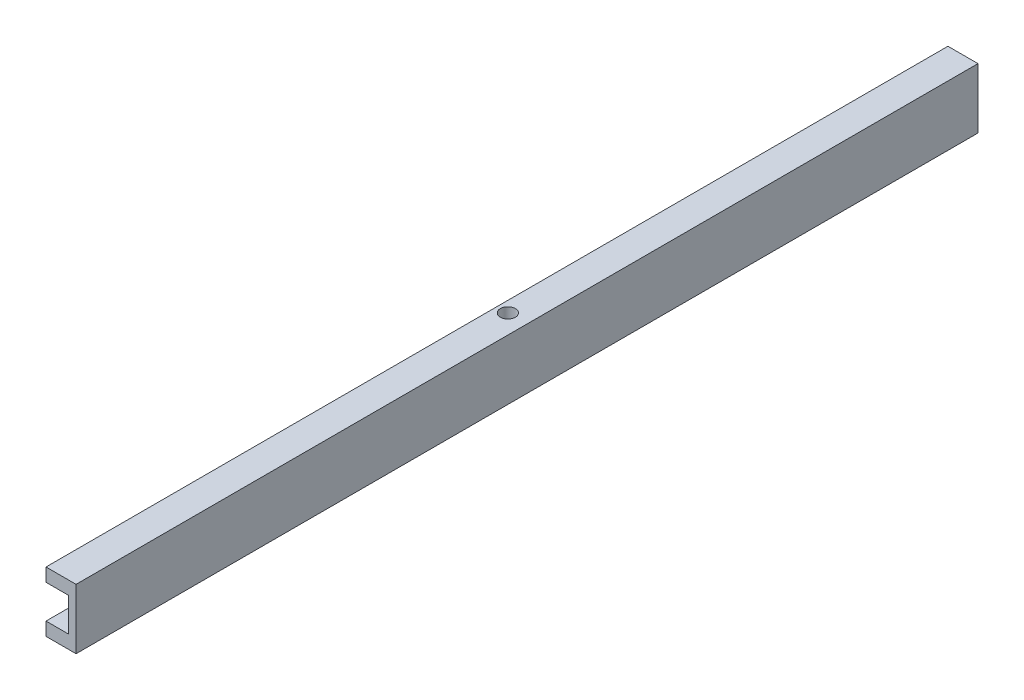
ISO-10303-21;
HEADER;
FILE_DESCRIPTION(('STEP AP214'),'2;1');
FILE_NAME('part.step','',(''),(''),'','','');
FILE_SCHEMA(('AUTOMOTIVE_DESIGN { 1 0 10303 214 1 1 1 1 }'));
ENDSEC;
DATA;
#1=APPLICATION_CONTEXT('core data for automotive mechanical design processes');
#2=APPLICATION_PROTOCOL_DEFINITION('international standard','automotive_design',2000,#1);
#3=PRODUCT_CONTEXT('',#1,'mechanical');
#4=PRODUCT('Part','Part','',(#3));
#5=PRODUCT_RELATED_PRODUCT_CATEGORY('part','',(#4));
#6=PRODUCT_DEFINITION_FORMATION('','',#4);
#7=PRODUCT_DEFINITION_CONTEXT('part definition',#1,'design');
#8=PRODUCT_DEFINITION('design','',#6,#7);
#9=PRODUCT_DEFINITION_SHAPE('','',#8);
#10=(LENGTH_UNIT() NAMED_UNIT(*) SI_UNIT(.MILLI.,.METRE.));
#11=(NAMED_UNIT(*) PLANE_ANGLE_UNIT() SI_UNIT($,.RADIAN.));
#12=(NAMED_UNIT(*) SI_UNIT($,.STERADIAN.) SOLID_ANGLE_UNIT());
#13=UNCERTAINTY_MEASURE_WITH_UNIT(LENGTH_MEASURE(1.E-05),#10,'distance_accuracy_value','');
#14=(GEOMETRIC_REPRESENTATION_CONTEXT(3) GLOBAL_UNCERTAINTY_ASSIGNED_CONTEXT((#13)) GLOBAL_UNIT_ASSIGNED_CONTEXT((#10,
#11,#12)) REPRESENTATION_CONTEXT('',''));
#15=CARTESIAN_POINT('',(0.,0.,0.));
#16=DIRECTION('',(0.,0.,1.));
#17=DIRECTION('',(1.,0.,0.));
#18=AXIS2_PLACEMENT_3D('',#15,#16,#17);
#19=CARTESIAN_POINT('',(9.525,0.,381.));
#20=DIRECTION('',(1.,0.,0.));
#21=DIRECTION('',(0.,1.,0.));
#22=AXIS2_PLACEMENT_3D('',#19,#20,#21);
#23=PLANE('',#22);
#24=DIRECTION('',(0.,-1.,0.));
#25=VECTOR('',#24,1.);
#26=CARTESIAN_POINT('',(9.525,0.,0.));
#27=LINE('',#26,#25);
#28=CARTESIAN_POINT('',(9.525,19.787500049,0.));
#29=VERTEX_POINT('',#28);
#30=CARTESIAN_POINT('',(9.525,5.612499951,0.));
#31=VERTEX_POINT('',#30);
#32=EDGE_CURVE('E157',#29,#31,#27,.T.);
#33=ORIENTED_EDGE('',*,*,#32,.T.);
#34=DIRECTION('',(0.,0.,-1.));
#35=VECTOR('',#34,1.);
#36=CARTESIAN_POINT('',(9.525,5.612499951,381.));
#37=LINE('',#36,#35);
#38=CARTESIAN_POINT('',(9.525,5.612499951,381.));
#39=VERTEX_POINT('',#38);
#40=EDGE_CURVE('E11',#39,#31,#37,.T.);
#41=ORIENTED_EDGE('',*,*,#40,.F.);
#42=DIRECTION('',(0.,-1.,0.));
#43=VECTOR('',#42,1.);
#44=CARTESIAN_POINT('',(9.525,0.,381.));
#45=LINE('',#44,#43);
#46=CARTESIAN_POINT('',(9.525,19.787500049,381.));
#47=VERTEX_POINT('',#46);
#48=EDGE_CURVE('E149',#47,#39,#45,.T.);
#49=ORIENTED_EDGE('',*,*,#48,.F.);
#50=DIRECTION('',(0.,0.,-1.));
#51=VECTOR('',#50,1.);
#52=CARTESIAN_POINT('',(9.525,19.787500049,381.));
#53=LINE('',#52,#51);
#54=EDGE_CURVE('E138',#47,#29,#53,.T.);
#55=ORIENTED_EDGE('',*,*,#54,.T.);
#56=EDGE_LOOP('',(#33,#41,#49,#55));
#57=FACE_BOUND('',#56,.T.);
#58=ADVANCED_FACE('F41',(#57),#23,.F.);
#59=CARTESIAN_POINT('',(0.,5.612499951,381.));
#60=DIRECTION('',(0.,-1.,0.));
#61=DIRECTION('',(1.,0.,0.));
#62=AXIS2_PLACEMENT_3D('',#59,#60,#61);
#63=PLANE('',#62);
#64=CARTESIAN_POINT('',(4.60375,5.61249995099999,190.5));
#65=DIRECTION('',(0.,-1.,0.));
#66=DIRECTION('',(1.,0.,0.));
#67=AXIS2_PLACEMENT_3D('',#64,#65,#66);
#68=CIRCLE('',#67,3.175);
#69=CARTESIAN_POINT('',(7.77875,5.61249995099999,190.5));
#70=VERTEX_POINT('',#69);
#71=EDGE_CURVE('E153',#70,#70,#68,.T.);
#72=ORIENTED_EDGE('',*,*,#71,.T.);
#73=EDGE_LOOP('',(#72));
#74=FACE_BOUND('',#73,.T.);
#75=DIRECTION('',(-1.,0.,0.));
#76=VECTOR('',#75,1.);
#77=CARTESIAN_POINT('',(0.,5.612499951,0.));
#78=LINE('',#77,#76);
#79=CARTESIAN_POINT('',(0.,5.612499951,0.));
#80=VERTEX_POINT('',#79);
#81=EDGE_CURVE('E199',#31,#80,#78,.T.);
#82=ORIENTED_EDGE('',*,*,#81,.T.);
#83=DIRECTION('',(0.,0.,-1.));
#84=VECTOR('',#83,1.);
#85=CARTESIAN_POINT('',(0.,5.612499951,381.));
#86=LINE('',#85,#84);
#87=CARTESIAN_POINT('',(0.,5.612499951,381.));
#88=VERTEX_POINT('',#87);
#89=EDGE_CURVE('E51',#88,#80,#86,.T.);
#90=ORIENTED_EDGE('',*,*,#89,.F.);
#91=DIRECTION('',(-1.,0.,0.));
#92=VECTOR('',#91,1.);
#93=CARTESIAN_POINT('',(0.,5.612499951,381.));
#94=LINE('',#93,#92);
#95=EDGE_CURVE('E98',#39,#88,#94,.T.);
#96=ORIENTED_EDGE('',*,*,#95,.F.);
#97=ORIENTED_EDGE('',*,*,#40,.T.);
#98=EDGE_LOOP('',(#82,#90,#96,#97));
#99=FACE_BOUND('',#98,.T.);
#100=ADVANCED_FACE('F187',(#74,#99),#63,.F.);
#101=CARTESIAN_POINT('',(0.,0.,381.));
#102=DIRECTION('',(-1.,0.,0.));
#103=DIRECTION('',(0.,-1.,0.));
#104=AXIS2_PLACEMENT_3D('',#101,#102,#103);
#105=PLANE('',#104);
#106=DIRECTION('',(0.,1.,0.));
#107=VECTOR('',#106,1.);
#108=CARTESIAN_POINT('',(0.,0.,0.));
#109=LINE('',#108,#107);
#110=CARTESIAN_POINT('',(0.,0.,0.));
#111=VERTEX_POINT('',#110);
#112=EDGE_CURVE('E203',#111,#80,#109,.T.);
#113=ORIENTED_EDGE('',*,*,#112,.F.);
#114=DIRECTION('',(0.,0.,-1.));
#115=VECTOR('',#114,1.);
#116=CARTESIAN_POINT('',(0.,0.,381.));
#117=LINE('',#116,#115);
#118=CARTESIAN_POINT('',(0.,0.,381.));
#119=VERTEX_POINT('',#118);
#120=EDGE_CURVE('E231',#119,#111,#117,.T.);
#121=ORIENTED_EDGE('',*,*,#120,.F.);
#122=DIRECTION('',(0.,1.,0.));
#123=VECTOR('',#122,1.);
#124=CARTESIAN_POINT('',(0.,0.,381.));
#125=LINE('',#124,#123);
#126=EDGE_CURVE('E136',#119,#88,#125,.T.);
#127=ORIENTED_EDGE('',*,*,#126,.T.);
#128=ORIENTED_EDGE('',*,*,#89,.T.);
#129=EDGE_LOOP('',(#113,#121,#127,#128));
#130=FACE_BOUND('',#129,.T.);
#131=ADVANCED_FACE('F192',(#130),#105,.T.);
#132=CARTESIAN_POINT('',(0.,0.,381.));
#133=DIRECTION('',(0.,1.,0.));
#134=DIRECTION('',(0.,0.,1.));
#135=AXIS2_PLACEMENT_3D('',#132,#133,#134);
#136=PLANE('',#135);
#137=CARTESIAN_POINT('',(4.60375,0.,190.5));
#138=DIRECTION('',(0.,1.,0.));
#139=DIRECTION('',(0.,0.,1.));
#140=AXIS2_PLACEMENT_3D('',#137,#138,#139);
#141=CIRCLE('',#140,3.175);
#142=CARTESIAN_POINT('',(4.60375,0.,193.675));
#143=VERTEX_POINT('',#142);
#144=EDGE_CURVE('E158',#143,#143,#141,.T.);
#145=ORIENTED_EDGE('',*,*,#144,.T.);
#146=EDGE_LOOP('',(#145));
#147=FACE_BOUND('',#146,.T.);
#148=DIRECTION('',(1.,0.,0.));
#149=VECTOR('',#148,1.);
#150=CARTESIAN_POINT('',(0.,0.,0.));
#151=LINE('',#150,#149);
#152=CARTESIAN_POINT('',(12.7,0.,0.));
#153=VERTEX_POINT('',#152);
#154=EDGE_CURVE('E209',#111,#153,#151,.T.);
#155=ORIENTED_EDGE('',*,*,#154,.T.);
#156=DIRECTION('',(0.,0.,-1.));
#157=VECTOR('',#156,1.);
#158=CARTESIAN_POINT('',(12.7,0.,381.));
#159=LINE('',#158,#157);
#160=CARTESIAN_POINT('',(12.7,0.,381.));
#161=VERTEX_POINT('',#160);
#162=EDGE_CURVE('E227',#161,#153,#159,.T.);
#163=ORIENTED_EDGE('',*,*,#162,.F.);
#164=DIRECTION('',(1.,0.,0.));
#165=VECTOR('',#164,1.);
#166=CARTESIAN_POINT('',(0.,0.,381.));
#167=LINE('',#166,#165);
#168=EDGE_CURVE('E144',#119,#161,#167,.T.);
#169=ORIENTED_EDGE('',*,*,#168,.F.);
#170=ORIENTED_EDGE('',*,*,#120,.T.);
#171=EDGE_LOOP('',(#155,#163,#169,#170));
#172=FACE_BOUND('',#171,.T.);
#173=ADVANCED_FACE('F240',(#147,#172),#136,.F.);
#174=CARTESIAN_POINT('',(12.7,0.,381.));
#175=DIRECTION('',(-1.,0.,0.));
#176=DIRECTION('',(0.,-1.,0.));
#177=AXIS2_PLACEMENT_3D('',#174,#175,#176);
#178=PLANE('',#177);
#179=DIRECTION('',(0.,1.,0.));
#180=VECTOR('',#179,1.);
#181=CARTESIAN_POINT('',(12.7,0.,0.));
#182=LINE('',#181,#180);
#183=CARTESIAN_POINT('',(12.7,25.4,0.));
#184=VERTEX_POINT('',#183);
#185=EDGE_CURVE('E213',#153,#184,#182,.T.);
#186=ORIENTED_EDGE('',*,*,#185,.T.);
#187=DIRECTION('',(0.,0.,-1.));
#188=VECTOR('',#187,1.);
#189=CARTESIAN_POINT('',(12.7,25.4,381.));
#190=LINE('',#189,#188);
#191=CARTESIAN_POINT('',(12.7,25.4,381.));
#192=VERTEX_POINT('',#191);
#193=EDGE_CURVE('E124',#192,#184,#190,.T.);
#194=ORIENTED_EDGE('',*,*,#193,.F.);
#195=DIRECTION('',(0.,1.,0.));
#196=VECTOR('',#195,1.);
#197=CARTESIAN_POINT('',(12.7,0.,381.));
#198=LINE('',#197,#196);
#199=EDGE_CURVE('E129',#161,#192,#198,.T.);
#200=ORIENTED_EDGE('',*,*,#199,.F.);
#201=ORIENTED_EDGE('',*,*,#162,.T.);
#202=EDGE_LOOP('',(#186,#194,#200,#201));
#203=FACE_BOUND('',#202,.T.);
#204=ADVANCED_FACE('F243',(#203),#178,.F.);
#205=CARTESIAN_POINT('',(0.,25.4,381.));
#206=DIRECTION('',(0.,1.,0.));
#207=DIRECTION('',(-1.,0.,0.));
#208=AXIS2_PLACEMENT_3D('',#205,#206,#207);
#209=PLANE('',#208);
#210=CARTESIAN_POINT('',(4.60374999999999,25.4,190.5));
#211=DIRECTION('',(0.,1.,0.));
#212=DIRECTION('',(-1.,0.,0.));
#213=AXIS2_PLACEMENT_3D('',#210,#211,#212);
#214=CIRCLE('',#213,3.175);
#215=CARTESIAN_POINT('',(1.42874999999999,25.4,190.5));
#216=VERTEX_POINT('',#215);
#217=EDGE_CURVE('E162',#216,#216,#214,.T.);
#218=ORIENTED_EDGE('',*,*,#217,.F.);
#219=EDGE_LOOP('',(#218));
#220=FACE_BOUND('',#219,.T.);
#221=DIRECTION('',(1.,0.,0.));
#222=VECTOR('',#221,1.);
#223=CARTESIAN_POINT('',(0.,25.4,0.));
#224=LINE('',#223,#222);
#225=CARTESIAN_POINT('',(0.,25.4,0.));
#226=VERTEX_POINT('',#225);
#227=EDGE_CURVE('E118',#226,#184,#224,.T.);
#228=ORIENTED_EDGE('',*,*,#227,.F.);
#229=DIRECTION('',(0.,0.,-1.));
#230=VECTOR('',#229,1.);
#231=CARTESIAN_POINT('',(0.,25.4,381.));
#232=LINE('',#231,#230);
#233=CARTESIAN_POINT('',(0.,25.4,381.));
#234=VERTEX_POINT('',#233);
#235=EDGE_CURVE('E113',#234,#226,#232,.T.);
#236=ORIENTED_EDGE('',*,*,#235,.F.);
#237=DIRECTION('',(1.,0.,0.));
#238=VECTOR('',#237,1.);
#239=CARTESIAN_POINT('',(0.,25.4,381.));
#240=LINE('',#239,#238);
#241=EDGE_CURVE('E116',#234,#192,#240,.T.);
#242=ORIENTED_EDGE('',*,*,#241,.T.);
#243=ORIENTED_EDGE('',*,*,#193,.T.);
#244=EDGE_LOOP('',(#228,#236,#242,#243));
#245=FACE_BOUND('',#244,.T.);
#246=ADVANCED_FACE('F115',(#220,#245),#209,.T.);
#247=CARTESIAN_POINT('',(0.,19.787500049,0.));
#248=VERTEX_POINT('',#247);
#249=EDGE_CURVE('E210',#248,#226,#109,.T.);
#250=ORIENTED_EDGE('',*,*,#249,.F.);
#251=DIRECTION('',(0.,0.,-1.));
#252=VECTOR('',#251,1.);
#253=CARTESIAN_POINT('',(0.,19.787500049,381.));
#254=LINE('',#253,#252);
#255=CARTESIAN_POINT('',(0.,19.787500049,381.));
#256=VERTEX_POINT('',#255);
#257=EDGE_CURVE('E87',#256,#248,#254,.T.);
#258=ORIENTED_EDGE('',*,*,#257,.F.);
#259=EDGE_CURVE('E127',#256,#234,#125,.T.);
#260=ORIENTED_EDGE('',*,*,#259,.T.);
#261=ORIENTED_EDGE('',*,*,#235,.T.);
#262=EDGE_LOOP('',(#250,#258,#260,#261));
#263=FACE_BOUND('',#262,.T.);
#264=ADVANCED_FACE('F133',(#263),#105,.T.);
#265=CARTESIAN_POINT('',(0.,19.787500049,381.));
#266=DIRECTION('',(0.,1.,0.));
#267=DIRECTION('',(-1.,0.,0.));
#268=AXIS2_PLACEMENT_3D('',#265,#266,#267);
#269=PLANE('',#268);
#270=CARTESIAN_POINT('',(4.60374999999999,19.787500049,190.5));
#271=DIRECTION('',(0.,1.,0.));
#272=DIRECTION('',(-1.,0.,0.));
#273=AXIS2_PLACEMENT_3D('',#270,#271,#272);
#274=CIRCLE('',#273,3.175);
#275=CARTESIAN_POINT('',(1.42874999999999,19.787500049,190.5));
#276=VERTEX_POINT('',#275);
#277=EDGE_CURVE('E44',#276,#276,#274,.T.);
#278=ORIENTED_EDGE('',*,*,#277,.T.);
#279=EDGE_LOOP('',(#278));
#280=FACE_BOUND('',#279,.T.);
#281=DIRECTION('',(1.,0.,0.));
#282=VECTOR('',#281,1.);
#283=CARTESIAN_POINT('',(0.,19.787500049,0.));
#284=LINE('',#283,#282);
#285=EDGE_CURVE('E90',#248,#29,#284,.T.);
#286=ORIENTED_EDGE('',*,*,#285,.T.);
#287=ORIENTED_EDGE('',*,*,#54,.F.);
#288=DIRECTION('',(1.,0.,0.));
#289=VECTOR('',#288,1.);
#290=CARTESIAN_POINT('',(0.,19.787500049,381.));
#291=LINE('',#290,#289);
#292=EDGE_CURVE('E59',#256,#47,#291,.T.);
#293=ORIENTED_EDGE('',*,*,#292,.F.);
#294=ORIENTED_EDGE('',*,*,#257,.T.);
#295=EDGE_LOOP('',(#286,#287,#293,#294));
#296=FACE_BOUND('',#295,.T.);
#297=ADVANCED_FACE('F171',(#280,#296),#269,.F.);
#298=CARTESIAN_POINT('',(0.,0.,381.));
#299=DIRECTION('',(0.,0.,1.));
#300=DIRECTION('',(1.,0.,0.));
#301=AXIS2_PLACEMENT_3D('',#298,#299,#300);
#302=PLANE('',#301);
#303=ORIENTED_EDGE('',*,*,#48,.T.);
#304=ORIENTED_EDGE('',*,*,#95,.T.);
#305=ORIENTED_EDGE('',*,*,#126,.F.);
#306=ORIENTED_EDGE('',*,*,#168,.T.);
#307=ORIENTED_EDGE('',*,*,#199,.T.);
#308=ORIENTED_EDGE('',*,*,#241,.F.);
#309=ORIENTED_EDGE('',*,*,#259,.F.);
#310=ORIENTED_EDGE('',*,*,#292,.T.);
#311=EDGE_LOOP('',(#303,#304,#305,#306,#307,#308,#309,#310));
#312=FACE_BOUND('',#311,.T.);
#313=ADVANCED_FACE('F126',(#312),#302,.T.);
#314=CARTESIAN_POINT('',(0.,0.,0.));
#315=DIRECTION('',(0.,0.,1.));
#316=DIRECTION('',(1.,0.,0.));
#317=AXIS2_PLACEMENT_3D('',#314,#315,#316);
#318=PLANE('',#317);
#319=ORIENTED_EDGE('',*,*,#32,.F.);
#320=ORIENTED_EDGE('',*,*,#285,.F.);
#321=ORIENTED_EDGE('',*,*,#249,.T.);
#322=ORIENTED_EDGE('',*,*,#227,.T.);
#323=ORIENTED_EDGE('',*,*,#185,.F.);
#324=ORIENTED_EDGE('',*,*,#154,.F.);
#325=ORIENTED_EDGE('',*,*,#112,.T.);
#326=ORIENTED_EDGE('',*,*,#81,.F.);
#327=EDGE_LOOP('',(#319,#320,#321,#322,#323,#324,#325,#326));
#328=FACE_BOUND('',#327,.T.);
#329=ADVANCED_FACE('F176',(#328),#318,.F.);
#330=CARTESIAN_POINT('',(4.6037500000002,-355.6,190.5));
#331=DIRECTION('',(0.,1.,0.));
#332=DIRECTION('',(-1.,0.,0.));
#333=AXIS2_PLACEMENT_3D('',#330,#331,#332);
#334=CYLINDRICAL_SURFACE('',#333,3.175);
#335=ORIENTED_EDGE('',*,*,#217,.T.);
#336=EDGE_LOOP('',(#335));
#337=FACE_BOUND('',#336,.T.);
#338=ORIENTED_EDGE('',*,*,#277,.F.);
#339=EDGE_LOOP('',(#338));
#340=FACE_BOUND('',#339,.T.);
#341=ADVANCED_FACE('F173',(#337,#340),#334,.F.);
#342=ORIENTED_EDGE('',*,*,#144,.F.);
#343=EDGE_LOOP('',(#342));
#344=FACE_BOUND('',#343,.T.);
#345=ORIENTED_EDGE('',*,*,#71,.F.);
#346=EDGE_LOOP('',(#345));
#347=FACE_BOUND('',#346,.T.);
#348=ADVANCED_FACE('F175',(#344,#347),#334,.F.);
#349=CLOSED_SHELL('',(#58,#100,#131,#173,#204,#246,#264,#297,#313,#329,#341,#348));
#350=MANIFOLD_SOLID_BREP('B2',#349);
#351=ADVANCED_BREP_SHAPE_REPRESENTATION('',(#18,#350),#14);
#352=SHAPE_DEFINITION_REPRESENTATION(#9,#351);
ENDSEC;
END-ISO-10303-21;
